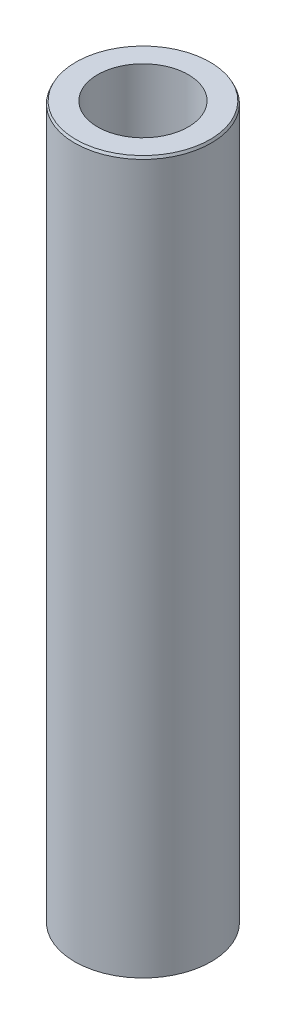
ISO-10303-21;
HEADER;
FILE_DESCRIPTION(('STEP AP214'),'2;1');
FILE_NAME('part.step','',(''),(''),'','','');
FILE_SCHEMA(('AUTOMOTIVE_DESIGN { 1 0 10303 214 1 1 1 1 }'));
ENDSEC;
DATA;
#1=APPLICATION_CONTEXT('core data for automotive mechanical design processes');
#2=APPLICATION_PROTOCOL_DEFINITION('international standard','automotive_design',2000,#1);
#3=PRODUCT_CONTEXT('',#1,'mechanical');
#4=PRODUCT('Part','Part','',(#3));
#5=PRODUCT_RELATED_PRODUCT_CATEGORY('part','',(#4));
#6=PRODUCT_DEFINITION_FORMATION('','',#4);
#7=PRODUCT_DEFINITION_CONTEXT('part definition',#1,'design');
#8=PRODUCT_DEFINITION('design','',#6,#7);
#9=PRODUCT_DEFINITION_SHAPE('','',#8);
#10=(LENGTH_UNIT() NAMED_UNIT(*) SI_UNIT(.MILLI.,.METRE.));
#11=(NAMED_UNIT(*) PLANE_ANGLE_UNIT() SI_UNIT($,.RADIAN.));
#12=(NAMED_UNIT(*) SI_UNIT($,.STERADIAN.) SOLID_ANGLE_UNIT());
#13=UNCERTAINTY_MEASURE_WITH_UNIT(LENGTH_MEASURE(1.E-05),#10,'distance_accuracy_value','');
#14=(GEOMETRIC_REPRESENTATION_CONTEXT(3) GLOBAL_UNCERTAINTY_ASSIGNED_CONTEXT((#13)) GLOBAL_UNIT_ASSIGNED_CONTEXT((#10,
#11,#12)) REPRESENTATION_CONTEXT('',''));
#15=CARTESIAN_POINT('',(0.,0.,0.));
#16=DIRECTION('',(0.,0.,1.));
#17=DIRECTION('',(1.,0.,0.));
#18=AXIS2_PLACEMENT_3D('',#15,#16,#17);
#19=CARTESIAN_POINT('',(0.,600.,0.));
#20=DIRECTION('',(0.,-1.,0.));
#21=DIRECTION('',(0.,0.,-1.));
#22=AXIS2_PLACEMENT_3D('',#19,#20,#21);
#23=CYLINDRICAL_SURFACE('',#22,57.5);
#24=CARTESIAN_POINT('',(0.,597.876739127926,0.));
#25=DIRECTION('',(0.,1.,0.));
#26=DIRECTION('',(0.,0.,1.));
#27=AXIS2_PLACEMENT_3D('',#24,#25,#26);
#28=CIRCLE('',#27,57.5);
#29=CARTESIAN_POINT('',(0.,597.876739127926,57.5));
#30=VERTEX_POINT('',#29);
#31=EDGE_CURVE('E50',#30,#30,#28,.F.);
#32=ORIENTED_EDGE('',*,*,#31,.T.);
#33=EDGE_LOOP('',(#32));
#34=FACE_BOUND('',#33,.T.);
#35=CARTESIAN_POINT('',(0.,1.00353512247475,0.));
#36=DIRECTION('',(0.,1.,0.));
#37=DIRECTION('',(0.,0.,1.));
#38=AXIS2_PLACEMENT_3D('',#35,#36,#37);
#39=CIRCLE('',#38,57.5);
#40=CARTESIAN_POINT('',(0.,1.00353512247475,57.5));
#41=VERTEX_POINT('',#40);
#42=EDGE_CURVE('E51',#41,#41,#39,.T.);
#43=ORIENTED_EDGE('',*,*,#42,.T.);
#44=EDGE_LOOP('',(#43));
#45=FACE_BOUND('',#44,.T.);
#46=ADVANCED_FACE('F39',(#34,#45),#23,.T.);
#47=CARTESIAN_POINT('',(0.,600.,0.));
#48=DIRECTION('',(0.,1.,0.));
#49=DIRECTION('',(0.,0.,1.));
#50=AXIS2_PLACEMENT_3D('',#47,#48,#49);
#51=PLANE('',#50);
#52=CARTESIAN_POINT('',(0.,600.,0.));
#53=DIRECTION('',(0.,1.,0.));
#54=DIRECTION('',(0.,0.,1.));
#55=AXIS2_PLACEMENT_3D('',#52,#53,#54);
#56=CIRCLE('',#55,56.4964648775254);
#57=CARTESIAN_POINT('',(0.,600.,56.4964648775254));
#58=VERTEX_POINT('',#57);
#59=EDGE_CURVE('E54',#58,#58,#56,.T.);
#60=ORIENTED_EDGE('',*,*,#59,.T.);
#61=EDGE_LOOP('',(#60));
#62=FACE_BOUND('',#61,.T.);
#63=CARTESIAN_POINT('',(0.,600.,0.));
#64=DIRECTION('',(0.,1.,0.));
#65=DIRECTION('',(0.,0.,1.));
#66=AXIS2_PLACEMENT_3D('',#63,#64,#65);
#67=CIRCLE('',#66,38.1865620807355);
#68=CARTESIAN_POINT('',(0.,600.,38.1865620807355));
#69=VERTEX_POINT('',#68);
#70=EDGE_CURVE('E58',#69,#69,#67,.T.);
#71=ORIENTED_EDGE('',*,*,#70,.F.);
#72=EDGE_LOOP('',(#71));
#73=FACE_BOUND('',#72,.T.);
#74=ADVANCED_FACE('F69',(#62,#73),#51,.T.);
#75=CARTESIAN_POINT('',(0.,0.,0.));
#76=DIRECTION('',(0.,1.,0.));
#77=DIRECTION('',(0.,0.,1.));
#78=AXIS2_PLACEMENT_3D('',#75,#76,#77);
#79=PLANE('',#78);
#80=CARTESIAN_POINT('',(0.,0.,0.));
#81=DIRECTION('',(0.,1.,0.));
#82=DIRECTION('',(0.,0.,1.));
#83=AXIS2_PLACEMENT_3D('',#80,#81,#82);
#84=CIRCLE('',#83,55.3767391279254);
#85=CARTESIAN_POINT('',(0.,0.,55.3767391279254));
#86=VERTEX_POINT('',#85);
#87=EDGE_CURVE('E10',#86,#86,#84,.F.);
#88=ORIENTED_EDGE('',*,*,#87,.T.);
#89=EDGE_LOOP('',(#88));
#90=FACE_BOUND('',#89,.T.);
#91=CARTESIAN_POINT('',(0.,0.,0.));
#92=DIRECTION('',(0.,1.,0.));
#93=DIRECTION('',(0.,0.,1.));
#94=AXIS2_PLACEMENT_3D('',#91,#92,#93);
#95=CIRCLE('',#94,38.1865620807355);
#96=CARTESIAN_POINT('',(0.,0.,38.1865620807355));
#97=VERTEX_POINT('',#96);
#98=EDGE_CURVE('E63',#97,#97,#95,.T.);
#99=ORIENTED_EDGE('',*,*,#98,.T.);
#100=EDGE_LOOP('',(#99));
#101=FACE_BOUND('',#100,.T.);
#102=ADVANCED_FACE('F75',(#90,#101),#79,.F.);
#103=CARTESIAN_POINT('',(0.,600.,0.));
#104=DIRECTION('',(0.,-1.,0.));
#105=DIRECTION('',(0.,0.,-1.));
#106=AXIS2_PLACEMENT_3D('',#103,#104,#105);
#107=CYLINDRICAL_SURFACE('',#106,38.1865620807355);
#108=ORIENTED_EDGE('',*,*,#70,.T.);
#109=EDGE_LOOP('',(#108));
#110=FACE_BOUND('',#109,.T.);
#111=ORIENTED_EDGE('',*,*,#98,.F.);
#112=EDGE_LOOP('',(#111));
#113=FACE_BOUND('',#112,.T.);
#114=ADVANCED_FACE('F70',(#110,#113),#107,.F.);
#115=CARTESIAN_POINT('',(0.,600.,0.));
#116=DIRECTION('',(0.,-1.,0.));
#117=DIRECTION('',(0.,0.,-1.));
#118=AXIS2_PLACEMENT_3D('',#115,#116,#117);
#119=CONICAL_SURFACE('',#118,56.4964648775254,0.441519912902636);
#120=ORIENTED_EDGE('',*,*,#31,.F.);
#121=EDGE_LOOP('',(#120));
#122=FACE_BOUND('',#121,.T.);
#123=ORIENTED_EDGE('',*,*,#59,.F.);
#124=EDGE_LOOP('',(#123));
#125=FACE_BOUND('',#124,.T.);
#126=ADVANCED_FACE('F81',(#122,#125),#119,.T.);
#127=CARTESIAN_POINT('',(0.,1.00353512247475,0.));
#128=DIRECTION('',(0.,1.,0.));
#129=DIRECTION('',(0.,0.,1.));
#130=AXIS2_PLACEMENT_3D('',#127,#128,#129);
#131=CONICAL_SURFACE('',#130,57.5,1.12927641389224);
#132=ORIENTED_EDGE('',*,*,#87,.F.);
#133=EDGE_LOOP('',(#132));
#134=FACE_BOUND('',#133,.T.);
#135=ORIENTED_EDGE('',*,*,#42,.F.);
#136=EDGE_LOOP('',(#135));
#137=FACE_BOUND('',#136,.T.);
#138=ADVANCED_FACE('F45',(#134,#137),#131,.T.);
#139=CLOSED_SHELL('',(#46,#74,#102,#114,#126,#138));
#140=MANIFOLD_SOLID_BREP('B2',#139);
#141=ADVANCED_BREP_SHAPE_REPRESENTATION('',(#18,#140),#14);
#142=SHAPE_DEFINITION_REPRESENTATION(#9,#141);
ENDSEC;
END-ISO-10303-21;
